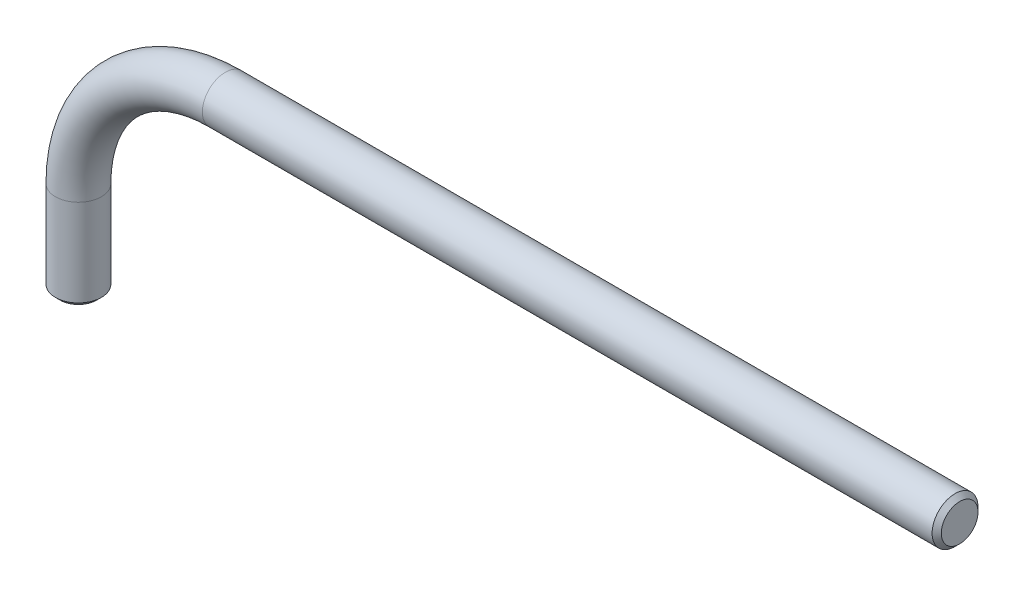
ISO-10303-21;
HEADER;
FILE_DESCRIPTION(('STEP AP214'),'2;1');
FILE_NAME('part.step','',(''),(''),'','','');
FILE_SCHEMA(('AUTOMOTIVE_DESIGN { 1 0 10303 214 1 1 1 1 }'));
ENDSEC;
DATA;
#1=APPLICATION_CONTEXT('core data for automotive mechanical design processes');
#2=APPLICATION_PROTOCOL_DEFINITION('international standard','automotive_design',2000,#1);
#3=PRODUCT_CONTEXT('',#1,'mechanical');
#4=PRODUCT('Part','Part','',(#3));
#5=PRODUCT_RELATED_PRODUCT_CATEGORY('part','',(#4));
#6=PRODUCT_DEFINITION_FORMATION('','',#4);
#7=PRODUCT_DEFINITION_CONTEXT('part definition',#1,'design');
#8=PRODUCT_DEFINITION('design','',#6,#7);
#9=PRODUCT_DEFINITION_SHAPE('','',#8);
#10=(LENGTH_UNIT() NAMED_UNIT(*) SI_UNIT(.MILLI.,.METRE.));
#11=(NAMED_UNIT(*) PLANE_ANGLE_UNIT() SI_UNIT($,.RADIAN.));
#12=(NAMED_UNIT(*) SI_UNIT($,.STERADIAN.) SOLID_ANGLE_UNIT());
#13=UNCERTAINTY_MEASURE_WITH_UNIT(LENGTH_MEASURE(1.E-05),#10,'distance_accuracy_value','');
#14=(GEOMETRIC_REPRESENTATION_CONTEXT(3) GLOBAL_UNCERTAINTY_ASSIGNED_CONTEXT((#13)) GLOBAL_UNIT_ASSIGNED_CONTEXT((#10,
#11,#12)) REPRESENTATION_CONTEXT('',''));
#15=CARTESIAN_POINT('',(0.,0.,0.));
#16=DIRECTION('',(0.,0.,1.));
#17=DIRECTION('',(1.,0.,0.));
#18=AXIS2_PLACEMENT_3D('',#15,#16,#17);
#19=CARTESIAN_POINT('',(0.,0.,0.));
#20=DIRECTION('',(1.,0.,0.));
#21=DIRECTION('',(0.,0.,1.));
#22=AXIS2_PLACEMENT_3D('',#19,#20,#21);
#23=PLANE('',#22);
#24=CARTESIAN_POINT('',(0.,0.,0.));
#25=DIRECTION('',(1.,0.,0.));
#26=DIRECTION('',(0.,0.,-1.));
#27=AXIS2_PLACEMENT_3D('',#24,#25,#26);
#28=CIRCLE('',#27,1.99999999999999);
#29=CARTESIAN_POINT('',(0.,0.,-1.99999999999999));
#30=VERTEX_POINT('',#29);
#31=EDGE_CURVE('E59',#30,#30,#28,.T.);
#32=ORIENTED_EDGE('',*,*,#31,.T.);
#33=EDGE_LOOP('',(#32));
#34=FACE_BOUND('',#33,.T.);
#35=ADVANCED_FACE('F44',(#34),#23,.T.);
#36=CARTESIAN_POINT('',(-96.,-26.,0.));
#37=DIRECTION('',(0.,1.,0.));
#38=DIRECTION('',(0.,0.,1.));
#39=AXIS2_PLACEMENT_3D('',#36,#37,#38);
#40=PLANE('',#39);
#41=CARTESIAN_POINT('',(-96.,-26.,0.));
#42=DIRECTION('',(0.,1.,0.));
#43=DIRECTION('',(0.,0.,1.));
#44=AXIS2_PLACEMENT_3D('',#41,#42,#43);
#45=CIRCLE('',#44,1.99999999999999);
#46=CARTESIAN_POINT('',(-96.,-26.,1.99999999999999));
#47=VERTEX_POINT('',#46);
#48=EDGE_CURVE('E11',#47,#47,#45,.F.);
#49=ORIENTED_EDGE('',*,*,#48,.T.);
#50=EDGE_LOOP('',(#49));
#51=FACE_BOUND('',#50,.T.);
#52=ADVANCED_FACE('F84',(#51),#40,.F.);
#53=CARTESIAN_POINT('',(0.,0.,0.));
#54=DIRECTION('',(-1.,0.,0.));
#55=DIRECTION('',(0.,0.,1.));
#56=AXIS2_PLACEMENT_3D('',#53,#54,#55);
#57=CYLINDRICAL_SURFACE('',#56,2.5);
#58=CARTESIAN_POINT('',(-0.500000000000009,0.,0.));
#59=DIRECTION('',(1.,0.,0.));
#60=DIRECTION('',(0.,0.,-1.));
#61=AXIS2_PLACEMENT_3D('',#58,#59,#60);
#62=CIRCLE('',#61,2.5);
#63=CARTESIAN_POINT('',(-0.500000000000009,0.,-2.5));
#64=VERTEX_POINT('',#63);
#65=EDGE_CURVE('E55',#64,#64,#62,.F.);
#66=ORIENTED_EDGE('',*,*,#65,.T.);
#67=EDGE_LOOP('',(#66));
#68=FACE_BOUND('',#67,.T.);
#69=CARTESIAN_POINT('',(-79.9999999999999,0.,0.));
#70=DIRECTION('',(1.,0.,0.));
#71=DIRECTION('',(0.,0.,1.));
#72=AXIS2_PLACEMENT_3D('',#69,#70,#71);
#73=CIRCLE('',#72,2.5);
#74=CARTESIAN_POINT('',(-79.9999999999999,2.5,0.));
#75=VERTEX_POINT('',#74);
#76=EDGE_CURVE('E67',#75,#75,#73,.T.);
#77=ORIENTED_EDGE('',*,*,#76,.T.);
#78=EDGE_LOOP('',(#77));
#79=FACE_BOUND('',#78,.T.);
#80=ADVANCED_FACE('F71',(#68,#79),#57,.T.);
#81=CARTESIAN_POINT('',(-80.,-16.,0.));
#82=DIRECTION('',(0.,0.,1.));
#83=DIRECTION('',(1.,0.,0.));
#84=AXIS2_PLACEMENT_3D('',#81,#82,#83);
#85=TOROIDAL_SURFACE('',#84,16.,2.5);
#86=CARTESIAN_POINT('',(-96.0000000000002,-15.9999999999995,0.));
#87=DIRECTION('',(0.,1.,0.));
#88=DIRECTION('',(0.,0.,1.));
#89=AXIS2_PLACEMENT_3D('',#86,#87,#88);
#90=CIRCLE('',#89,2.5);
#91=CARTESIAN_POINT('',(-98.5,-15.9999999999994,0.));
#92=VERTEX_POINT('',#91);
#93=EDGE_CURVE('E64',#92,#92,#90,.T.);
#94=CARTESIAN_POINT('',(-80.,-16.,0.));
#95=DIRECTION('',(0.,0.,1.));
#96=DIRECTION('',(1.,0.,0.));
#97=AXIS2_PLACEMENT_3D('',#94,#95,#96);
#98=CIRCLE('',#97,18.5);
#99=EDGE_CURVE('',#75,#92,#98,.T.);
#100=ORIENTED_EDGE('',*,*,#76,.F.);
#101=ORIENTED_EDGE('',*,*,#93,.T.);
#102=ORIENTED_EDGE('',*,*,#99,.T.);
#103=ORIENTED_EDGE('',*,*,#99,.F.);
#104=EDGE_LOOP('',(#100,#102,#101,#103));
#105=FACE_BOUND('',#104,.T.);
#106=ADVANCED_FACE('F73',(#105),#85,.T.);
#107=CARTESIAN_POINT('',(-96.,-16.0000000000001,0.));
#108=DIRECTION('',(0.,-1.,0.));
#109=DIRECTION('',(0.,0.,-1.));
#110=AXIS2_PLACEMENT_3D('',#107,#108,#109);
#111=CYLINDRICAL_SURFACE('',#110,2.5);
#112=CARTESIAN_POINT('',(-96.,-25.5,0.));
#113=DIRECTION('',(0.,1.,0.));
#114=DIRECTION('',(0.,0.,1.));
#115=AXIS2_PLACEMENT_3D('',#112,#113,#114);
#116=CIRCLE('',#115,2.5);
#117=CARTESIAN_POINT('',(-96.,-25.5,2.5));
#118=VERTEX_POINT('',#117);
#119=EDGE_CURVE('E51',#118,#118,#116,.T.);
#120=ORIENTED_EDGE('',*,*,#119,.T.);
#121=EDGE_LOOP('',(#120));
#122=FACE_BOUND('',#121,.T.);
#123=ORIENTED_EDGE('',*,*,#93,.F.);
#124=EDGE_LOOP('',(#123));
#125=FACE_BOUND('',#124,.T.);
#126=ADVANCED_FACE('F75',(#122,#125),#111,.T.);
#127=CARTESIAN_POINT('',(0.,0.,0.));
#128=DIRECTION('',(-1.,0.,0.));
#129=DIRECTION('',(0.,0.,1.));
#130=AXIS2_PLACEMENT_3D('',#127,#128,#129);
#131=CONICAL_SURFACE('',#130,1.99999999999999,0.785398163397454);
#132=ORIENTED_EDGE('',*,*,#65,.F.);
#133=EDGE_LOOP('',(#132));
#134=FACE_BOUND('',#133,.T.);
#135=ORIENTED_EDGE('',*,*,#31,.F.);
#136=EDGE_LOOP('',(#135));
#137=FACE_BOUND('',#136,.T.);
#138=ADVANCED_FACE('F82',(#134,#137),#131,.T.);
#139=CARTESIAN_POINT('',(-96.,-25.5,0.));
#140=DIRECTION('',(0.,1.,0.));
#141=DIRECTION('',(0.,0.,1.));
#142=AXIS2_PLACEMENT_3D('',#139,#140,#141);
#143=CONICAL_SURFACE('',#142,2.5,0.785398163397462);
#144=ORIENTED_EDGE('',*,*,#48,.F.);
#145=EDGE_LOOP('',(#144));
#146=FACE_BOUND('',#145,.T.);
#147=ORIENTED_EDGE('',*,*,#119,.F.);
#148=EDGE_LOOP('',(#147));
#149=FACE_BOUND('',#148,.T.);
#150=ADVANCED_FACE('F46',(#146,#149),#143,.T.);
#151=CLOSED_SHELL('',(#35,#52,#80,#106,#126,#138,#150));
#152=MANIFOLD_SOLID_BREP('B2',#151);
#153=ADVANCED_BREP_SHAPE_REPRESENTATION('',(#18,#152),#14);
#154=SHAPE_DEFINITION_REPRESENTATION(#9,#153);
ENDSEC;
END-ISO-10303-21;
